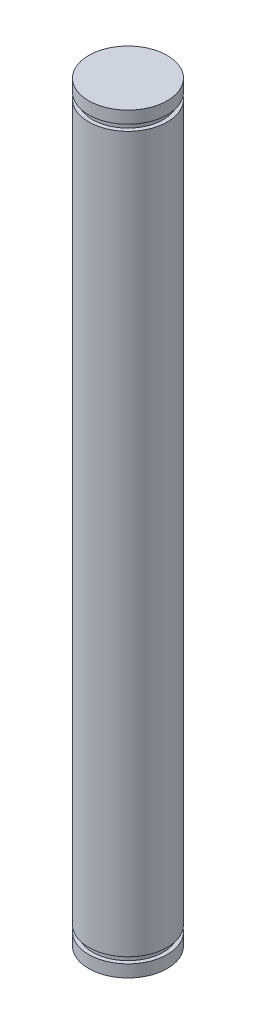
ISO-10303-21;
HEADER;
FILE_DESCRIPTION(('STEP AP214'),'2;1');
FILE_NAME('part.step','',(''),(''),'','','');
FILE_SCHEMA(('AUTOMOTIVE_DESIGN { 1 0 10303 214 1 1 1 1 }'));
ENDSEC;
DATA;
#1=APPLICATION_CONTEXT('core data for automotive mechanical design processes');
#2=APPLICATION_PROTOCOL_DEFINITION('international standard','automotive_design',2000,#1);
#3=PRODUCT_CONTEXT('',#1,'mechanical');
#4=PRODUCT('Part','Part','',(#3));
#5=PRODUCT_RELATED_PRODUCT_CATEGORY('part','',(#4));
#6=PRODUCT_DEFINITION_FORMATION('','',#4);
#7=PRODUCT_DEFINITION_CONTEXT('part definition',#1,'design');
#8=PRODUCT_DEFINITION('design','',#6,#7);
#9=PRODUCT_DEFINITION_SHAPE('','',#8);
#10=(LENGTH_UNIT() NAMED_UNIT(*) SI_UNIT(.MILLI.,.METRE.));
#11=(NAMED_UNIT(*) PLANE_ANGLE_UNIT() SI_UNIT($,.RADIAN.));
#12=(NAMED_UNIT(*) SI_UNIT($,.STERADIAN.) SOLID_ANGLE_UNIT());
#13=UNCERTAINTY_MEASURE_WITH_UNIT(LENGTH_MEASURE(1.E-05),#10,'distance_accuracy_value','');
#14=(GEOMETRIC_REPRESENTATION_CONTEXT(3) GLOBAL_UNCERTAINTY_ASSIGNED_CONTEXT((#13)) GLOBAL_UNIT_ASSIGNED_CONTEXT((#10,
#11,#12)) REPRESENTATION_CONTEXT('',''));
#15=CARTESIAN_POINT('',(0.,0.,0.));
#16=DIRECTION('',(0.,0.,1.));
#17=DIRECTION('',(1.,0.,0.));
#18=AXIS2_PLACEMENT_3D('',#15,#16,#17);
#19=CARTESIAN_POINT('',(0.,59.69,0.));
#20=DIRECTION('',(0.,-1.,0.));
#21=DIRECTION('',(0.,0.,-1.));
#22=AXIS2_PLACEMENT_3D('',#19,#20,#21);
#23=CYLINDRICAL_SURFACE('',#22,6.35);
#24=CARTESIAN_POINT('',(0.,-58.7756,0.));
#25=DIRECTION('',(0.,1.,0.));
#26=DIRECTION('',(0.,0.,1.));
#27=AXIS2_PLACEMENT_3D('',#24,#25,#26);
#28=CIRCLE('',#27,6.35);
#29=CARTESIAN_POINT('',(0.,-58.7756,6.35));
#30=VERTEX_POINT('',#29);
#31=EDGE_CURVE('E12',#30,#30,#28,.T.);
#32=ORIENTED_EDGE('',*,*,#31,.F.);
#33=EDGE_LOOP('',(#32));
#34=FACE_BOUND('',#33,.T.);
#35=CARTESIAN_POINT('',(0.,-60.754499902,0.));
#36=DIRECTION('',(0.,1.,0.));
#37=DIRECTION('',(0.,0.,1.));
#38=AXIS2_PLACEMENT_3D('',#35,#36,#37);
#39=CIRCLE('',#38,6.35);
#40=CARTESIAN_POINT('',(0.,-60.754499902,6.35));
#41=VERTEX_POINT('',#40);
#42=EDGE_CURVE('E91',#41,#41,#39,.T.);
#43=ORIENTED_EDGE('',*,*,#42,.T.);
#44=EDGE_LOOP('',(#43));
#45=FACE_BOUND('',#44,.T.);
#46=ADVANCED_FACE('F49',(#34,#45),#23,.T.);
#47=CARTESIAN_POINT('',(0.,-58.7756,0.));
#48=DIRECTION('',(0.,1.,0.));
#49=DIRECTION('',(0.,0.,1.));
#50=AXIS2_PLACEMENT_3D('',#47,#48,#49);
#51=PLANE('',#50);
#52=CARTESIAN_POINT('',(0.,-58.7756,0.));
#53=DIRECTION('',(0.,1.,0.));
#54=DIRECTION('',(0.,0.,1.));
#55=AXIS2_PLACEMENT_3D('',#52,#53,#54);
#56=CIRCLE('',#55,5.715);
#57=CARTESIAN_POINT('',(0.,-58.7756,5.715));
#58=VERTEX_POINT('',#57);
#59=EDGE_CURVE('E62',#58,#58,#56,.T.);
#60=ORIENTED_EDGE('',*,*,#59,.F.);
#61=EDGE_LOOP('',(#60));
#62=FACE_BOUND('',#61,.T.);
#63=ORIENTED_EDGE('',*,*,#31,.T.);
#64=EDGE_LOOP('',(#63));
#65=FACE_BOUND('',#64,.T.);
#66=ADVANCED_FACE('F108',(#62,#65),#51,.T.);
#67=CARTESIAN_POINT('',(0.,-57.785,0.));
#68=DIRECTION('',(0.,1.,0.));
#69=DIRECTION('',(0.,0.,1.));
#70=AXIS2_PLACEMENT_3D('',#67,#68,#69);
#71=PLANE('',#70);
#72=CARTESIAN_POINT('',(0.,-57.785,0.));
#73=DIRECTION('',(0.,1.,0.));
#74=DIRECTION('',(0.,0.,1.));
#75=AXIS2_PLACEMENT_3D('',#72,#73,#74);
#76=CIRCLE('',#75,5.715);
#77=CARTESIAN_POINT('',(0.,-57.785,5.715));
#78=VERTEX_POINT('',#77);
#79=EDGE_CURVE('E64',#78,#78,#76,.T.);
#80=ORIENTED_EDGE('',*,*,#79,.T.);
#81=EDGE_LOOP('',(#80));
#82=FACE_BOUND('',#81,.T.);
#83=CARTESIAN_POINT('',(0.,-57.785,0.));
#84=DIRECTION('',(0.,1.,0.));
#85=DIRECTION('',(0.,0.,1.));
#86=AXIS2_PLACEMENT_3D('',#83,#84,#85);
#87=CIRCLE('',#86,6.35);
#88=CARTESIAN_POINT('',(0.,-57.785,6.35));
#89=VERTEX_POINT('',#88);
#90=EDGE_CURVE('E53',#89,#89,#87,.T.);
#91=ORIENTED_EDGE('',*,*,#90,.F.);
#92=EDGE_LOOP('',(#91));
#93=FACE_BOUND('',#92,.T.);
#94=ADVANCED_FACE('F115',(#82,#93),#71,.F.);
#95=CARTESIAN_POINT('',(0.,-58.7756,0.));
#96=DIRECTION('',(0.,1.,0.));
#97=DIRECTION('',(0.,0.,1.));
#98=AXIS2_PLACEMENT_3D('',#95,#96,#97);
#99=CYLINDRICAL_SURFACE('',#98,5.715);
#100=ORIENTED_EDGE('',*,*,#59,.T.);
#101=EDGE_LOOP('',(#100));
#102=FACE_BOUND('',#101,.T.);
#103=ORIENTED_EDGE('',*,*,#79,.F.);
#104=EDGE_LOOP('',(#103));
#105=FACE_BOUND('',#104,.T.);
#106=ADVANCED_FACE('F120',(#102,#105),#99,.T.);
#107=CARTESIAN_POINT('',(0.,57.785,0.));
#108=DIRECTION('',(0.,1.,0.));
#109=DIRECTION('',(0.,0.,1.));
#110=AXIS2_PLACEMENT_3D('',#107,#108,#109);
#111=CIRCLE('',#110,6.35);
#112=CARTESIAN_POINT('',(0.,57.785,6.35));
#113=VERTEX_POINT('',#112);
#114=EDGE_CURVE('E72',#113,#113,#111,.T.);
#115=ORIENTED_EDGE('',*,*,#114,.F.);
#116=EDGE_LOOP('',(#115));
#117=FACE_BOUND('',#116,.T.);
#118=ORIENTED_EDGE('',*,*,#90,.T.);
#119=EDGE_LOOP('',(#118));
#120=FACE_BOUND('',#119,.T.);
#121=ADVANCED_FACE('F51',(#117,#120),#23,.T.);
#122=CARTESIAN_POINT('',(0.,58.7756,0.));
#123=DIRECTION('',(0.,-1.,0.));
#124=DIRECTION('',(0.,0.,1.));
#125=AXIS2_PLACEMENT_3D('',#122,#123,#124);
#126=PLANE('',#125);
#127=CARTESIAN_POINT('',(0.,58.7756,0.));
#128=DIRECTION('',(0.,1.,0.));
#129=DIRECTION('',(0.,0.,1.));
#130=AXIS2_PLACEMENT_3D('',#127,#128,#129);
#131=CIRCLE('',#130,6.35);
#132=CARTESIAN_POINT('',(0.,58.7756,6.35));
#133=VERTEX_POINT('',#132);
#134=EDGE_CURVE('E68',#133,#133,#131,.T.);
#135=ORIENTED_EDGE('',*,*,#134,.F.);
#136=EDGE_LOOP('',(#135));
#137=FACE_BOUND('',#136,.T.);
#138=CARTESIAN_POINT('',(0.,58.7756,0.));
#139=DIRECTION('',(0.,1.,0.));
#140=DIRECTION('',(0.,0.,1.));
#141=AXIS2_PLACEMENT_3D('',#138,#139,#140);
#142=CIRCLE('',#141,5.715);
#143=CARTESIAN_POINT('',(0.,58.7756,5.715));
#144=VERTEX_POINT('',#143);
#145=EDGE_CURVE('E76',#144,#144,#142,.T.);
#146=ORIENTED_EDGE('',*,*,#145,.T.);
#147=EDGE_LOOP('',(#146));
#148=FACE_BOUND('',#147,.T.);
#149=ADVANCED_FACE('F119',(#137,#148),#126,.T.);
#150=CARTESIAN_POINT('',(0.,57.785,0.));
#151=DIRECTION('',(0.,-1.,0.));
#152=DIRECTION('',(0.,0.,1.));
#153=AXIS2_PLACEMENT_3D('',#150,#151,#152);
#154=PLANE('',#153);
#155=ORIENTED_EDGE('',*,*,#114,.T.);
#156=EDGE_LOOP('',(#155));
#157=FACE_BOUND('',#156,.T.);
#158=CARTESIAN_POINT('',(0.,57.785,0.));
#159=DIRECTION('',(0.,1.,0.));
#160=DIRECTION('',(0.,0.,1.));
#161=AXIS2_PLACEMENT_3D('',#158,#159,#160);
#162=CIRCLE('',#161,5.715);
#163=CARTESIAN_POINT('',(0.,57.785,5.715));
#164=VERTEX_POINT('',#163);
#165=EDGE_CURVE('E80',#164,#164,#162,.T.);
#166=ORIENTED_EDGE('',*,*,#165,.F.);
#167=EDGE_LOOP('',(#166));
#168=FACE_BOUND('',#167,.T.);
#169=ADVANCED_FACE('F126',(#157,#168),#154,.F.);
#170=CARTESIAN_POINT('',(0.,58.7756,0.));
#171=DIRECTION('',(0.,-1.,0.));
#172=DIRECTION('',(0.,0.,-1.));
#173=AXIS2_PLACEMENT_3D('',#170,#171,#172);
#174=CYLINDRICAL_SURFACE('',#173,5.715);
#175=ORIENTED_EDGE('',*,*,#145,.F.);
#176=EDGE_LOOP('',(#175));
#177=FACE_BOUND('',#176,.T.);
#178=ORIENTED_EDGE('',*,*,#165,.T.);
#179=EDGE_LOOP('',(#178));
#180=FACE_BOUND('',#179,.T.);
#181=ADVANCED_FACE('F122',(#177,#180),#174,.T.);
#182=ORIENTED_EDGE('',*,*,#134,.T.);
#183=EDGE_LOOP('',(#182));
#184=FACE_BOUND('',#183,.T.);
#185=CARTESIAN_POINT('',(0.,60.754499902,0.));
#186=DIRECTION('',(0.,1.,0.));
#187=DIRECTION('',(0.,0.,1.));
#188=AXIS2_PLACEMENT_3D('',#185,#186,#187);
#189=CIRCLE('',#188,6.35);
#190=CARTESIAN_POINT('',(0.,60.754499902,6.35));
#191=VERTEX_POINT('',#190);
#192=EDGE_CURVE('E84',#191,#191,#189,.T.);
#193=ORIENTED_EDGE('',*,*,#192,.F.);
#194=EDGE_LOOP('',(#193));
#195=FACE_BOUND('',#194,.T.);
#196=ADVANCED_FACE('F104',(#184,#195),#23,.T.);
#197=CARTESIAN_POINT('',(0.,60.754499902,0.));
#198=DIRECTION('',(0.,1.,0.));
#199=DIRECTION('',(0.,0.,1.));
#200=AXIS2_PLACEMENT_3D('',#197,#198,#199);
#201=PLANE('',#200);
#202=ORIENTED_EDGE('',*,*,#192,.T.);
#203=EDGE_LOOP('',(#202));
#204=FACE_BOUND('',#203,.T.);
#205=ADVANCED_FACE('F99',(#204),#201,.T.);
#206=CARTESIAN_POINT('',(0.,-60.754499902,0.));
#207=DIRECTION('',(0.,-1.,0.));
#208=DIRECTION('',(0.,0.,1.));
#209=AXIS2_PLACEMENT_3D('',#206,#207,#208);
#210=PLANE('',#209);
#211=ORIENTED_EDGE('',*,*,#42,.F.);
#212=EDGE_LOOP('',(#211));
#213=FACE_BOUND('',#212,.T.);
#214=ADVANCED_FACE('F97',(#213),#210,.T.);
#215=CLOSED_SHELL('',(#46,#66,#94,#106,#121,#149,#169,#181,#196,#205,#214));
#216=MANIFOLD_SOLID_BREP('B2',#215);
#217=ADVANCED_BREP_SHAPE_REPRESENTATION('',(#18,#216),#14);
#218=SHAPE_DEFINITION_REPRESENTATION(#9,#217);
ENDSEC;
END-ISO-10303-21;
